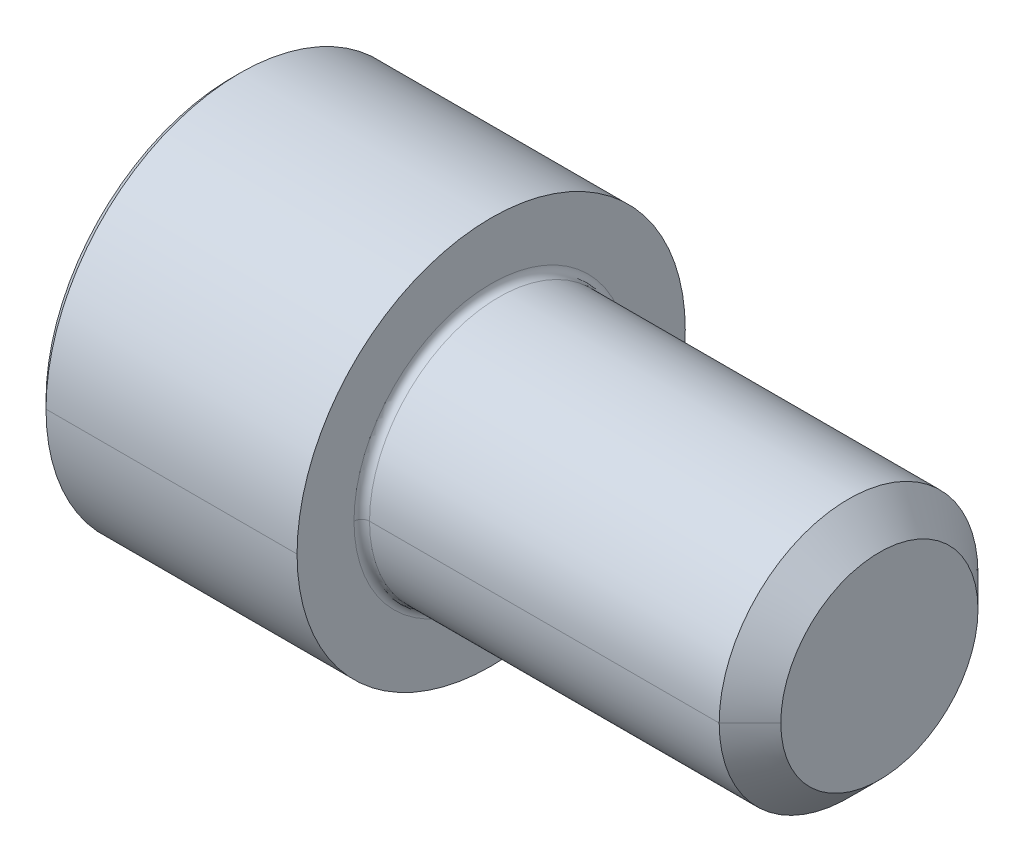
ISO-10303-21;
HEADER;
FILE_DESCRIPTION(('STEP AP214'),'2;1');
FILE_NAME('part.step','',(''),(''),'','','');
FILE_SCHEMA(('AUTOMOTIVE_DESIGN { 1 0 10303 214 1 1 1 1 }'));
ENDSEC;
DATA;
#1=APPLICATION_CONTEXT('core data for automotive mechanical design processes');
#2=APPLICATION_PROTOCOL_DEFINITION('international standard','automotive_design',2000,#1);
#3=PRODUCT_CONTEXT('',#1,'mechanical');
#4=PRODUCT('Part','Part','',(#3));
#5=PRODUCT_RELATED_PRODUCT_CATEGORY('part','',(#4));
#6=PRODUCT_DEFINITION_FORMATION('','',#4);
#7=PRODUCT_DEFINITION_CONTEXT('part definition',#1,'design');
#8=PRODUCT_DEFINITION('design','',#6,#7);
#9=PRODUCT_DEFINITION_SHAPE('','',#8);
#10=(LENGTH_UNIT() NAMED_UNIT(*) SI_UNIT(.MILLI.,.METRE.));
#11=(NAMED_UNIT(*) PLANE_ANGLE_UNIT() SI_UNIT($,.RADIAN.));
#12=(NAMED_UNIT(*) SI_UNIT($,.STERADIAN.) SOLID_ANGLE_UNIT());
#13=UNCERTAINTY_MEASURE_WITH_UNIT(LENGTH_MEASURE(1.E-05),#10,'distance_accuracy_value','');
#14=(GEOMETRIC_REPRESENTATION_CONTEXT(3) GLOBAL_UNCERTAINTY_ASSIGNED_CONTEXT((#13)) GLOBAL_UNIT_ASSIGNED_CONTEXT((#10,
#11,#12)) REPRESENTATION_CONTEXT('',''));
#15=CARTESIAN_POINT('',(0.,0.,0.));
#16=DIRECTION('',(0.,0.,1.));
#17=DIRECTION('',(1.,0.,0.));
#18=AXIS2_PLACEMENT_3D('',#15,#16,#17);
#19=CARTESIAN_POINT('',(-3.302,0.,0.));
#20=DIRECTION('',(-1.,0.,0.));
#21=DIRECTION('',(0.,1.,0.));
#22=AXIS2_PLACEMENT_3D('',#19,#20,#21);
#23=CONICAL_SURFACE('',#22,2.38125,1.0471975512);
#24=DIRECTION('',(-0.499999999997054,0.,-0.86602540378614));
#25=VECTOR('',#24,1.);
#26=CARTESIAN_POINT('',(-1.92718467150301,0.,0.));
#27=LINE('',#26,#25);
#28=CARTESIAN_POINT('',(-1.9271846714922,0.,0.));
#29=VERTEX_POINT('',#28);
#30=CARTESIAN_POINT('',(-3.302,0.,-2.38125));
#31=VERTEX_POINT('',#30);
#32=EDGE_CURVE('E11',#29,#31,#27,.T.);
#33=ORIENTED_EDGE('',*,*,#32,.T.);
#34=CARTESIAN_POINT('',(-3.302,0.,0.));
#35=DIRECTION('',(1.,0.,0.));
#36=DIRECTION('',(0.,0.,-1.));
#37=AXIS2_PLACEMENT_3D('',#34,#35,#36);
#38=CIRCLE('',#37,2.38125);
#39=CARTESIAN_POINT('',(-3.302,-2.06222299276169,-1.190625));
#40=VERTEX_POINT('',#39);
#41=EDGE_CURVE('E25',#40,#31,#38,.T.);
#42=ORIENTED_EDGE('',*,*,#41,.F.);
#43=CARTESIAN_POINT('',(-3.302,0.,0.));
#44=DIRECTION('',(1.,0.,0.));
#45=DIRECTION('',(0.,0.,-1.));
#46=AXIS2_PLACEMENT_3D('',#43,#44,#45);
#47=CIRCLE('',#46,2.38125);
#48=CARTESIAN_POINT('',(-3.302,-2.06222299276169,1.190625));
#49=VERTEX_POINT('',#48);
#50=EDGE_CURVE('E433',#49,#40,#47,.T.);
#51=ORIENTED_EDGE('',*,*,#50,.F.);
#52=CARTESIAN_POINT('',(-3.302,0.,0.));
#53=DIRECTION('',(1.,0.,0.));
#54=DIRECTION('',(0.,0.,-1.));
#55=AXIS2_PLACEMENT_3D('',#52,#53,#54);
#56=CIRCLE('',#55,2.38125);
#57=CARTESIAN_POINT('',(-3.302,0.,2.38125));
#58=VERTEX_POINT('',#57);
#59=EDGE_CURVE('E428',#58,#49,#56,.T.);
#60=ORIENTED_EDGE('',*,*,#59,.F.);
#61=DIRECTION('',(-0.499999999997054,0.,0.86602540378614));
#62=VECTOR('',#61,1.);
#63=CARTESIAN_POINT('',(-1.92718467150301,0.,0.));
#64=LINE('',#63,#62);
#65=EDGE_CURVE('E423',#29,#58,#64,.T.);
#66=ORIENTED_EDGE('',*,*,#65,.F.);
#67=EDGE_LOOP('',(#33,#42,#51,#60,#66));
#68=FACE_BOUND('',#67,.T.);
#69=ADVANCED_FACE('F17',(#68),#23,.F.);
#70=CARTESIAN_POINT('',(-3.302,0.,0.));
#71=DIRECTION('',(-1.,0.,0.));
#72=DIRECTION('',(0.,-1.,0.));
#73=AXIS2_PLACEMENT_3D('',#70,#71,#72);
#74=CONICAL_SURFACE('',#73,2.38125,1.0471975512);
#75=ORIENTED_EDGE('',*,*,#65,.T.);
#76=CARTESIAN_POINT('',(-3.302,0.,0.));
#77=DIRECTION('',(1.,0.,0.));
#78=DIRECTION('',(0.,0.,-1.));
#79=AXIS2_PLACEMENT_3D('',#76,#77,#78);
#80=CIRCLE('',#79,2.38125);
#81=CARTESIAN_POINT('',(-3.302,2.06222299276169,1.190625));
#82=VERTEX_POINT('',#81);
#83=EDGE_CURVE('E418',#82,#58,#80,.T.);
#84=ORIENTED_EDGE('',*,*,#83,.F.);
#85=CARTESIAN_POINT('',(-3.302,0.,0.));
#86=DIRECTION('',(1.,0.,0.));
#87=DIRECTION('',(0.,0.,-1.));
#88=AXIS2_PLACEMENT_3D('',#85,#86,#87);
#89=CIRCLE('',#88,2.38125);
#90=CARTESIAN_POINT('',(-3.302,2.0622229927617,-1.19062500000001));
#91=VERTEX_POINT('',#90);
#92=EDGE_CURVE('E413',#91,#82,#89,.T.);
#93=ORIENTED_EDGE('',*,*,#92,.F.);
#94=CARTESIAN_POINT('',(-3.302,0.,0.));
#95=DIRECTION('',(1.,0.,0.));
#96=DIRECTION('',(0.,0.,-1.));
#97=AXIS2_PLACEMENT_3D('',#94,#95,#96);
#98=CIRCLE('',#97,2.38125);
#99=EDGE_CURVE('E408',#31,#91,#98,.T.);
#100=ORIENTED_EDGE('',*,*,#99,.F.);
#101=ORIENTED_EDGE('',*,*,#32,.F.);
#102=EDGE_LOOP('',(#75,#84,#93,#100,#101));
#103=FACE_BOUND('',#102,.T.);
#104=ADVANCED_FACE('F466',(#103),#74,.F.);
#105=CARTESIAN_POINT('',(-3.302,0.,0.));
#106=DIRECTION('',(1.,0.,0.));
#107=DIRECTION('',(0.,0.,-1.));
#108=AXIS2_PLACEMENT_3D('',#105,#106,#107);
#109=PLANE('',#108);
#110=ORIENTED_EDGE('',*,*,#99,.T.);
#111=DIRECTION('',(0.,0.500000000000001,0.866025403784438));
#112=VECTOR('',#111,1.);
#113=CARTESIAN_POINT('',(-3.302,1.3748153285078,-2.38125));
#114=LINE('',#113,#112);
#115=CARTESIAN_POINT('',(-3.302,1.3748153285078,-2.38125));
#116=VERTEX_POINT('',#115);
#117=EDGE_CURVE('E403',#116,#91,#114,.T.);
#118=ORIENTED_EDGE('',*,*,#117,.F.);
#119=DIRECTION('',(0.,1.,0.));
#120=VECTOR('',#119,1.);
#121=CARTESIAN_POINT('',(-3.302,-1.3748153285078,-2.38125));
#122=LINE('',#121,#120);
#123=EDGE_CURVE('E398',#31,#116,#122,.T.);
#124=ORIENTED_EDGE('',*,*,#123,.F.);
#125=EDGE_LOOP('',(#110,#118,#124));
#126=FACE_BOUND('',#125,.T.);
#127=ADVANCED_FACE('F482',(#126),#109,.F.);
#128=CARTESIAN_POINT('',(-3.302,-1.3748153285078,-2.38125));
#129=DIRECTION('',(0.,0.,1.));
#130=DIRECTION('',(1.,0.,0.));
#131=AXIS2_PLACEMENT_3D('',#128,#129,#130);
#132=PLANE('',#131);
#133=DIRECTION('',(0.,1.,0.));
#134=VECTOR('',#133,1.);
#135=CARTESIAN_POINT('',(-6.35,-1.3748153285078,-2.38125));
#136=LINE('',#135,#134);
#137=CARTESIAN_POINT('',(-6.35,-1.3748153285078,-2.38125));
#138=VERTEX_POINT('',#137);
#139=CARTESIAN_POINT('',(-6.35,1.3748153285078,-2.38125));
#140=VERTEX_POINT('',#139);
#141=EDGE_CURVE('E393',#138,#140,#136,.T.);
#142=ORIENTED_EDGE('',*,*,#141,.F.);
#143=DIRECTION('',(-1.,0.,0.));
#144=VECTOR('',#143,1.);
#145=CARTESIAN_POINT('',(-3.302,-1.3748153285078,-2.38125));
#146=LINE('',#145,#144);
#147=CARTESIAN_POINT('',(-3.302,-1.3748153285078,-2.38125));
#148=VERTEX_POINT('',#147);
#149=EDGE_CURVE('E388',#148,#138,#146,.T.);
#150=ORIENTED_EDGE('',*,*,#149,.F.);
#151=DIRECTION('',(0.,1.,0.));
#152=VECTOR('',#151,1.);
#153=CARTESIAN_POINT('',(-3.302,-1.3748153285078,-2.38125));
#154=LINE('',#153,#152);
#155=EDGE_CURVE('E383',#148,#31,#154,.T.);
#156=ORIENTED_EDGE('',*,*,#155,.T.);
#157=ORIENTED_EDGE('',*,*,#123,.T.);
#158=DIRECTION('',(-1.,0.,0.));
#159=VECTOR('',#158,1.);
#160=CARTESIAN_POINT('',(-3.302,1.3748153285078,-2.38125));
#161=LINE('',#160,#159);
#162=EDGE_CURVE('E379',#116,#140,#161,.T.);
#163=ORIENTED_EDGE('',*,*,#162,.T.);
#164=EDGE_LOOP('',(#142,#150,#156,#157,#163));
#165=FACE_BOUND('',#164,.T.);
#166=ADVANCED_FACE('F484',(#165),#132,.T.);
#167=CARTESIAN_POINT('',(-3.302,1.3748153285078,-2.38125));
#168=DIRECTION('',(0.,-0.866025403784438,0.500000000000001));
#169=DIRECTION('',(0.,-0.500000000000001,-0.866025403784438));
#170=AXIS2_PLACEMENT_3D('',#167,#168,#169);
#171=PLANE('',#170);
#172=DIRECTION('',(0.,0.500000000000001,0.866025403784438));
#173=VECTOR('',#172,1.);
#174=CARTESIAN_POINT('',(-6.35,1.3748153285078,-2.38125));
#175=LINE('',#174,#173);
#176=CARTESIAN_POINT('',(-6.35,2.7496306570156,0.));
#177=VERTEX_POINT('',#176);
#178=EDGE_CURVE('E374',#140,#177,#175,.T.);
#179=ORIENTED_EDGE('',*,*,#178,.F.);
#180=ORIENTED_EDGE('',*,*,#162,.F.);
#181=ORIENTED_EDGE('',*,*,#117,.T.);
#182=DIRECTION('',(0.,0.500000000000001,0.866025403784438));
#183=VECTOR('',#182,1.);
#184=CARTESIAN_POINT('',(-3.302,1.3748153285078,-2.38125));
#185=LINE('',#184,#183);
#186=CARTESIAN_POINT('',(-3.302,2.7496306570156,0.));
#187=VERTEX_POINT('',#186);
#188=EDGE_CURVE('E370',#91,#187,#185,.T.);
#189=ORIENTED_EDGE('',*,*,#188,.T.);
#190=DIRECTION('',(-1.,0.,0.));
#191=VECTOR('',#190,1.);
#192=CARTESIAN_POINT('',(-3.302,2.7496306570156,0.));
#193=LINE('',#192,#191);
#194=EDGE_CURVE('E366',#187,#177,#193,.T.);
#195=ORIENTED_EDGE('',*,*,#194,.T.);
#196=EDGE_LOOP('',(#179,#180,#181,#189,#195));
#197=FACE_BOUND('',#196,.T.);
#198=ADVANCED_FACE('F478',(#197),#171,.T.);
#199=CARTESIAN_POINT('',(-3.302,2.7496306570156,0.));
#200=DIRECTION('',(0.,-0.866025403784438,-0.500000000000001));
#201=DIRECTION('',(0.,0.500000000000001,-0.866025403784438));
#202=AXIS2_PLACEMENT_3D('',#199,#200,#201);
#203=PLANE('',#202);
#204=DIRECTION('',(0.,-0.500000000000001,0.866025403784438));
#205=VECTOR('',#204,1.);
#206=CARTESIAN_POINT('',(-6.35,2.7496306570156,0.));
#207=LINE('',#206,#205);
#208=CARTESIAN_POINT('',(-6.35,1.3748153285078,2.38125));
#209=VERTEX_POINT('',#208);
#210=EDGE_CURVE('E361',#177,#209,#207,.T.);
#211=ORIENTED_EDGE('',*,*,#210,.F.);
#212=ORIENTED_EDGE('',*,*,#194,.F.);
#213=DIRECTION('',(0.,-0.500000000000001,0.866025403784438));
#214=VECTOR('',#213,1.);
#215=CARTESIAN_POINT('',(-3.302,2.7496306570156,0.));
#216=LINE('',#215,#214);
#217=EDGE_CURVE('E356',#187,#82,#216,.T.);
#218=ORIENTED_EDGE('',*,*,#217,.T.);
#219=DIRECTION('',(0.,-0.500000000000001,0.866025403784438));
#220=VECTOR('',#219,1.);
#221=CARTESIAN_POINT('',(-3.302,2.7496306570156,0.));
#222=LINE('',#221,#220);
#223=CARTESIAN_POINT('',(-3.302,1.3748153285078,2.38125));
#224=VERTEX_POINT('',#223);
#225=EDGE_CURVE('E352',#82,#224,#222,.T.);
#226=ORIENTED_EDGE('',*,*,#225,.T.);
#227=DIRECTION('',(-1.,0.,0.));
#228=VECTOR('',#227,1.);
#229=CARTESIAN_POINT('',(-3.302,1.3748153285078,2.38125));
#230=LINE('',#229,#228);
#231=EDGE_CURVE('E348',#224,#209,#230,.T.);
#232=ORIENTED_EDGE('',*,*,#231,.T.);
#233=EDGE_LOOP('',(#211,#212,#218,#226,#232));
#234=FACE_BOUND('',#233,.T.);
#235=ADVANCED_FACE('F471',(#234),#203,.T.);
#236=CARTESIAN_POINT('',(-3.302,1.3748153285078,2.38125));
#237=DIRECTION('',(0.,0.,-1.));
#238=DIRECTION('',(-1.,0.,0.));
#239=AXIS2_PLACEMENT_3D('',#236,#237,#238);
#240=PLANE('',#239);
#241=DIRECTION('',(0.,-1.,0.));
#242=VECTOR('',#241,1.);
#243=CARTESIAN_POINT('',(-6.35,1.3748153285078,2.38125));
#244=LINE('',#243,#242);
#245=CARTESIAN_POINT('',(-6.35,-1.3748153285078,2.38125));
#246=VERTEX_POINT('',#245);
#247=EDGE_CURVE('E343',#209,#246,#244,.T.);
#248=ORIENTED_EDGE('',*,*,#247,.F.);
#249=ORIENTED_EDGE('',*,*,#231,.F.);
#250=DIRECTION('',(0.,-1.,0.));
#251=VECTOR('',#250,1.);
#252=CARTESIAN_POINT('',(-3.302,1.3748153285078,2.38125));
#253=LINE('',#252,#251);
#254=EDGE_CURVE('E338',#224,#58,#253,.T.);
#255=ORIENTED_EDGE('',*,*,#254,.T.);
#256=DIRECTION('',(0.,-1.,0.));
#257=VECTOR('',#256,1.);
#258=CARTESIAN_POINT('',(-3.302,1.3748153285078,2.38125));
#259=LINE('',#258,#257);
#260=CARTESIAN_POINT('',(-3.302,-1.3748153285078,2.38125));
#261=VERTEX_POINT('',#260);
#262=EDGE_CURVE('E334',#58,#261,#259,.T.);
#263=ORIENTED_EDGE('',*,*,#262,.T.);
#264=DIRECTION('',(-1.,0.,0.));
#265=VECTOR('',#264,1.);
#266=CARTESIAN_POINT('',(-3.302,-1.3748153285078,2.38125));
#267=LINE('',#266,#265);
#268=EDGE_CURVE('E330',#261,#246,#267,.T.);
#269=ORIENTED_EDGE('',*,*,#268,.T.);
#270=EDGE_LOOP('',(#248,#249,#255,#263,#269));
#271=FACE_BOUND('',#270,.T.);
#272=ADVANCED_FACE('F490',(#271),#240,.T.);
#273=CARTESIAN_POINT('',(-3.302,-1.3748153285078,2.38125));
#274=DIRECTION('',(0.,0.866025403784438,-0.500000000000001));
#275=DIRECTION('',(0.,0.500000000000001,0.866025403784438));
#276=AXIS2_PLACEMENT_3D('',#273,#274,#275);
#277=PLANE('',#276);
#278=DIRECTION('',(0.,-0.500000000000001,-0.866025403784438));
#279=VECTOR('',#278,1.);
#280=CARTESIAN_POINT('',(-6.35,-1.3748153285078,2.38125));
#281=LINE('',#280,#279);
#282=CARTESIAN_POINT('',(-6.35,-2.7496306570156,0.));
#283=VERTEX_POINT('',#282);
#284=EDGE_CURVE('E325',#246,#283,#281,.T.);
#285=ORIENTED_EDGE('',*,*,#284,.F.);
#286=ORIENTED_EDGE('',*,*,#268,.F.);
#287=DIRECTION('',(0.,-0.500000000000001,-0.866025403784438));
#288=VECTOR('',#287,1.);
#289=CARTESIAN_POINT('',(-3.302,-1.3748153285078,2.38125));
#290=LINE('',#289,#288);
#291=EDGE_CURVE('E320',#261,#49,#290,.T.);
#292=ORIENTED_EDGE('',*,*,#291,.T.);
#293=DIRECTION('',(0.,-0.500000000000001,-0.866025403784438));
#294=VECTOR('',#293,1.);
#295=CARTESIAN_POINT('',(-3.302,-1.3748153285078,2.38125));
#296=LINE('',#295,#294);
#297=CARTESIAN_POINT('',(-3.302,-2.7496306570156,0.));
#298=VERTEX_POINT('',#297);
#299=EDGE_CURVE('E316',#49,#298,#296,.T.);
#300=ORIENTED_EDGE('',*,*,#299,.T.);
#301=DIRECTION('',(-1.,0.,0.));
#302=VECTOR('',#301,1.);
#303=CARTESIAN_POINT('',(-3.302,-2.7496306570156,0.));
#304=LINE('',#303,#302);
#305=EDGE_CURVE('E312',#298,#283,#304,.T.);
#306=ORIENTED_EDGE('',*,*,#305,.T.);
#307=EDGE_LOOP('',(#285,#286,#292,#300,#306));
#308=FACE_BOUND('',#307,.T.);
#309=ADVANCED_FACE('F455',(#308),#277,.T.);
#310=CARTESIAN_POINT('',(-3.302,-2.7496306570156,0.));
#311=DIRECTION('',(0.,0.866025403784438,0.500000000000001));
#312=DIRECTION('',(0.,-0.500000000000001,0.866025403784438));
#313=AXIS2_PLACEMENT_3D('',#310,#311,#312);
#314=PLANE('',#313);
#315=DIRECTION('',(0.,0.500000000000001,-0.866025403784438));
#316=VECTOR('',#315,1.);
#317=CARTESIAN_POINT('',(-6.35,-2.7496306570156,0.));
#318=LINE('',#317,#316);
#319=EDGE_CURVE('E307',#283,#138,#318,.T.);
#320=ORIENTED_EDGE('',*,*,#319,.F.);
#321=ORIENTED_EDGE('',*,*,#305,.F.);
#322=DIRECTION('',(0.,0.500000000000001,-0.866025403784438));
#323=VECTOR('',#322,1.);
#324=CARTESIAN_POINT('',(-3.302,-2.7496306570156,0.));
#325=LINE('',#324,#323);
#326=EDGE_CURVE('E303',#298,#40,#325,.T.);
#327=ORIENTED_EDGE('',*,*,#326,.T.);
#328=DIRECTION('',(0.,0.500000000000001,-0.866025403784438));
#329=VECTOR('',#328,1.);
#330=CARTESIAN_POINT('',(-3.302,-2.7496306570156,0.));
#331=LINE('',#330,#329);
#332=EDGE_CURVE('E298',#40,#148,#331,.T.);
#333=ORIENTED_EDGE('',*,*,#332,.T.);
#334=ORIENTED_EDGE('',*,*,#149,.T.);
#335=EDGE_LOOP('',(#320,#321,#327,#333,#334));
#336=FACE_BOUND('',#335,.T.);
#337=ADVANCED_FACE('F486',(#336),#314,.T.);
#338=CARTESIAN_POINT('',(-3.302,0.,0.));
#339=DIRECTION('',(1.,0.,0.));
#340=DIRECTION('',(0.,0.,-1.));
#341=AXIS2_PLACEMENT_3D('',#338,#339,#340);
#342=PLANE('',#341);
#343=ORIENTED_EDGE('',*,*,#41,.T.);
#344=ORIENTED_EDGE('',*,*,#155,.F.);
#345=ORIENTED_EDGE('',*,*,#332,.F.);
#346=EDGE_LOOP('',(#343,#344,#345));
#347=FACE_BOUND('',#346,.T.);
#348=ADVANCED_FACE('F445',(#347),#342,.F.);
#349=CARTESIAN_POINT('',(-3.302,0.,0.));
#350=DIRECTION('',(1.,0.,0.));
#351=DIRECTION('',(0.,0.,-1.));
#352=AXIS2_PLACEMENT_3D('',#349,#350,#351);
#353=PLANE('',#352);
#354=ORIENTED_EDGE('',*,*,#50,.T.);
#355=ORIENTED_EDGE('',*,*,#326,.F.);
#356=ORIENTED_EDGE('',*,*,#299,.F.);
#357=EDGE_LOOP('',(#354,#355,#356));
#358=FACE_BOUND('',#357,.T.);
#359=ADVANCED_FACE('F450',(#358),#353,.F.);
#360=CARTESIAN_POINT('',(-6.35,0.,0.));
#361=DIRECTION('',(1.,0.,0.));
#362=DIRECTION('',(0.,0.,-1.));
#363=AXIS2_PLACEMENT_3D('',#360,#361,#362);
#364=PLANE('',#363);
#365=CARTESIAN_POINT('',(-6.35,0.,0.));
#366=DIRECTION('',(1.,0.,0.));
#367=DIRECTION('',(0.,0.,-1.));
#368=AXIS2_PLACEMENT_3D('',#365,#366,#367);
#369=CIRCLE('',#368,4.572);
#370=CARTESIAN_POINT('',(-6.35,0.,-4.572));
#371=VERTEX_POINT('',#370);
#372=CARTESIAN_POINT('',(-6.35,0.,4.572));
#373=VERTEX_POINT('',#372);
#374=EDGE_CURVE('E293',#371,#373,#369,.T.);
#375=ORIENTED_EDGE('',*,*,#374,.F.);
#376=CARTESIAN_POINT('',(-6.35,0.,0.));
#377=DIRECTION('',(1.,0.,0.));
#378=DIRECTION('',(0.,0.,-1.));
#379=AXIS2_PLACEMENT_3D('',#376,#377,#378);
#380=CIRCLE('',#379,4.572);
#381=EDGE_CURVE('E288',#373,#371,#380,.T.);
#382=ORIENTED_EDGE('',*,*,#381,.F.);
#383=EDGE_LOOP('',(#375,#382));
#384=FACE_BOUND('',#383,.T.);
#385=ORIENTED_EDGE('',*,*,#247,.T.);
#386=ORIENTED_EDGE('',*,*,#284,.T.);
#387=ORIENTED_EDGE('',*,*,#319,.T.);
#388=ORIENTED_EDGE('',*,*,#141,.T.);
#389=ORIENTED_EDGE('',*,*,#178,.T.);
#390=ORIENTED_EDGE('',*,*,#210,.T.);
#391=EDGE_LOOP('',(#385,#386,#387,#388,#389,#390));
#392=FACE_BOUND('',#391,.T.);
#393=ADVANCED_FACE('F488',(#384,#392),#364,.F.);
#394=CARTESIAN_POINT('',(-6.35,0.,0.));
#395=DIRECTION('',(1.,0.,0.));
#396=DIRECTION('',(0.,1.,0.));
#397=AXIS2_PLACEMENT_3D('',#394,#395,#396);
#398=CONICAL_SURFACE('',#397,4.572,0.7853981634);
#399=ORIENTED_EDGE('',*,*,#381,.T.);
#400=DIRECTION('',(0.707106781184748,0.,-0.707106781188348));
#401=VECTOR('',#400,1.);
#402=CARTESIAN_POINT('',(-6.35,0.,-4.572));
#403=LINE('',#402,#401);
#404=CARTESIAN_POINT('',(-6.1595,0.,-4.7625));
#405=VERTEX_POINT('',#404);
#406=EDGE_CURVE('E284',#371,#405,#403,.T.);
#407=ORIENTED_EDGE('',*,*,#406,.T.);
#408=CARTESIAN_POINT('',(-6.1595,0.,0.));
#409=DIRECTION('',(1.,0.,0.));
#410=DIRECTION('',(0.,0.,-1.));
#411=AXIS2_PLACEMENT_3D('',#408,#409,#410);
#412=CIRCLE('',#411,4.7625);
#413=CARTESIAN_POINT('',(-6.1595,0.,4.7625));
#414=VERTEX_POINT('',#413);
#415=EDGE_CURVE('E279',#414,#405,#412,.T.);
#416=ORIENTED_EDGE('',*,*,#415,.F.);
#417=DIRECTION('',(0.707106781184748,0.,0.707106781188348));
#418=VECTOR('',#417,1.);
#419=CARTESIAN_POINT('',(-6.35,0.,4.572));
#420=LINE('',#419,#418);
#421=EDGE_CURVE('E274',#373,#414,#420,.T.);
#422=ORIENTED_EDGE('',*,*,#421,.F.);
#423=EDGE_LOOP('',(#399,#407,#416,#422));
#424=FACE_BOUND('',#423,.T.);
#425=ADVANCED_FACE('F567',(#424),#398,.T.);
#426=CARTESIAN_POINT('',(-6.35,0.,0.));
#427=DIRECTION('',(1.,0.,0.));
#428=DIRECTION('',(0.,-1.,0.));
#429=AXIS2_PLACEMENT_3D('',#426,#427,#428);
#430=CONICAL_SURFACE('',#429,4.572,0.7853981634);
#431=CARTESIAN_POINT('',(-6.1595,0.,0.));
#432=DIRECTION('',(1.,0.,0.));
#433=DIRECTION('',(0.,0.,-1.));
#434=AXIS2_PLACEMENT_3D('',#431,#432,#433);
#435=CIRCLE('',#434,4.7625);
#436=EDGE_CURVE('E269',#405,#414,#435,.T.);
#437=ORIENTED_EDGE('',*,*,#436,.F.);
#438=ORIENTED_EDGE('',*,*,#406,.F.);
#439=ORIENTED_EDGE('',*,*,#374,.T.);
#440=ORIENTED_EDGE('',*,*,#421,.T.);
#441=EDGE_LOOP('',(#437,#438,#439,#440));
#442=FACE_BOUND('',#441,.T.);
#443=ADVANCED_FACE('F577',(#442),#430,.T.);
#444=CARTESIAN_POINT('',(9.525,0.,0.));
#445=DIRECTION('',(-1.,0.,0.));
#446=DIRECTION('',(0.,-1.,0.));
#447=AXIS2_PLACEMENT_3D('',#444,#445,#446);
#448=CYLINDRICAL_SURFACE('',#447,4.7625);
#449=CARTESIAN_POINT('',(0.,0.,0.));
#450=DIRECTION('',(1.,0.,0.));
#451=DIRECTION('',(0.,0.,-1.));
#452=AXIS2_PLACEMENT_3D('',#449,#450,#451);
#453=CIRCLE('',#452,4.7625);
#454=CARTESIAN_POINT('',(0.,0.,-4.7625));
#455=VERTEX_POINT('',#454);
#456=CARTESIAN_POINT('',(0.,0.,4.7625));
#457=VERTEX_POINT('',#456);
#458=EDGE_CURVE('E264',#455,#457,#453,.T.);
#459=ORIENTED_EDGE('',*,*,#458,.F.);
#460=DIRECTION('',(-1.,0.,0.));
#461=VECTOR('',#460,1.);
#462=CARTESIAN_POINT('',(0.,0.,-4.7625));
#463=LINE('',#462,#461);
#464=EDGE_CURVE('E259',#455,#405,#463,.T.);
#465=ORIENTED_EDGE('',*,*,#464,.T.);
#466=ORIENTED_EDGE('',*,*,#436,.T.);
#467=DIRECTION('',(-1.,0.,0.));
#468=VECTOR('',#467,1.);
#469=CARTESIAN_POINT('',(0.,0.,4.7625));
#470=LINE('',#469,#468);
#471=EDGE_CURVE('E254',#457,#414,#470,.T.);
#472=ORIENTED_EDGE('',*,*,#471,.F.);
#473=EDGE_LOOP('',(#459,#465,#466,#472));
#474=FACE_BOUND('',#473,.T.);
#475=ADVANCED_FACE('F587',(#474),#448,.T.);
#476=CARTESIAN_POINT('',(9.525,0.,0.));
#477=DIRECTION('',(-1.,0.,0.));
#478=DIRECTION('',(0.,1.,0.));
#479=AXIS2_PLACEMENT_3D('',#476,#477,#478);
#480=CYLINDRICAL_SURFACE('',#479,4.7625);
#481=ORIENTED_EDGE('',*,*,#415,.T.);
#482=ORIENTED_EDGE('',*,*,#464,.F.);
#483=CARTESIAN_POINT('',(0.,0.,0.));
#484=DIRECTION('',(1.,0.,0.));
#485=DIRECTION('',(0.,0.,-1.));
#486=AXIS2_PLACEMENT_3D('',#483,#484,#485);
#487=CIRCLE('',#486,4.7625);
#488=EDGE_CURVE('E249',#457,#455,#487,.T.);
#489=ORIENTED_EDGE('',*,*,#488,.F.);
#490=ORIENTED_EDGE('',*,*,#471,.T.);
#491=EDGE_LOOP('',(#481,#482,#489,#490));
#492=FACE_BOUND('',#491,.T.);
#493=ADVANCED_FACE('F597',(#492),#480,.T.);
#494=CARTESIAN_POINT('',(0.,4.7625,0.));
#495=DIRECTION('',(-1.,0.,0.));
#496=DIRECTION('',(0.,0.,1.));
#497=AXIS2_PLACEMENT_3D('',#494,#495,#496);
#498=PLANE('',#497);
#499=CARTESIAN_POINT('',(0.,0.,0.));
#500=DIRECTION('',(1.,0.,0.));
#501=DIRECTION('',(0.,0.,-1.));
#502=AXIS2_PLACEMENT_3D('',#499,#500,#501);
#503=CIRCLE('',#502,3.3655);
#504=CARTESIAN_POINT('',(0.,0.,-3.3655));
#505=VERTEX_POINT('',#504);
#506=CARTESIAN_POINT('',(0.,0.,3.3655));
#507=VERTEX_POINT('',#506);
#508=EDGE_CURVE('E245',#505,#507,#503,.T.);
#509=ORIENTED_EDGE('',*,*,#508,.F.);
#510=CARTESIAN_POINT('',(0.,0.,0.));
#511=DIRECTION('',(1.,0.,0.));
#512=DIRECTION('',(0.,0.,-1.));
#513=AXIS2_PLACEMENT_3D('',#510,#511,#512);
#514=CIRCLE('',#513,3.3655);
#515=EDGE_CURVE('E241',#507,#505,#514,.T.);
#516=ORIENTED_EDGE('',*,*,#515,.F.);
#517=EDGE_LOOP('',(#509,#516));
#518=FACE_BOUND('',#517,.T.);
#519=ORIENTED_EDGE('',*,*,#458,.T.);
#520=ORIENTED_EDGE('',*,*,#488,.T.);
#521=EDGE_LOOP('',(#519,#520));
#522=FACE_BOUND('',#521,.T.);
#523=ADVANCED_FACE('F607',(#518,#522),#498,.F.);
#524=CARTESIAN_POINT('',(0.190500000000065,0.,0.));
#525=DIRECTION('',(1.,0.,0.));
#526=DIRECTION('',(0.,1.,0.));
#527=AXIS2_PLACEMENT_3D('',#524,#525,#526);
#528=TOROIDAL_SURFACE('',#527,3.3655,0.1905);
#529=CARTESIAN_POINT('',(0.1905,0.,0.));
#530=DIRECTION('',(1.,0.,0.));
#531=DIRECTION('',(0.,0.,-1.));
#532=AXIS2_PLACEMENT_3D('',#529,#530,#531);
#533=CIRCLE('',#532,3.175);
#534=CARTESIAN_POINT('',(0.1905,0.,3.175));
#535=VERTEX_POINT('',#534);
#536=CARTESIAN_POINT('',(0.1905,0.,-3.175));
#537=VERTEX_POINT('',#536);
#538=EDGE_CURVE('E238',#535,#537,#533,.T.);
#539=ORIENTED_EDGE('',*,*,#538,.F.);
#540=CARTESIAN_POINT('',(0.1905,0.,3.175));
#541=CARTESIAN_POINT('',(0.187382947891301,0.,3.17499993387959));
#542=CARTESIAN_POINT('',(0.184265901408801,0.,3.17507650153766));
#543=CARTESIAN_POINT('',(0.178039314672457,0.,3.17538242964818));
#544=CARTESIAN_POINT('',(0.174929774418612,0.,3.17561179010062));
#545=CARTESIAN_POINT('',(0.168725695115834,0.,3.17622282903729));
#546=CARTESIAN_POINT('',(0.165631156066901,0.,3.17660450752151));
#547=CARTESIAN_POINT('',(0.159464533165619,0.,3.17751924218192));
#548=CARTESIAN_POINT('',(0.15639244931327,0.,3.17805229835811));
#549=CARTESIAN_POINT('',(0.150278137998604,0.,3.17926850980828));
#550=CARTESIAN_POINT('',(0.147235910536287,0.,3.17995166508226));
#551=CARTESIAN_POINT('',(0.141188640920593,0.,3.18146642745065));
#552=CARTESIAN_POINT('',(0.138183598767217,0.,3.18229803454507));
#553=CARTESIAN_POINT('',(0.132217939198862,0.,3.18410769754099));
#554=CARTESIAN_POINT('',(0.129257321783883,0.,3.18508575344249));
#555=CARTESIAN_POINT('',(0.123387644073716,0.,3.18718595772281));
#556=CARTESIAN_POINT('',(0.120478583778528,0.,3.18830810610162));
#557=CARTESIAN_POINT('',(0.114719028490413,0.,3.19069379201161));
#558=CARTESIAN_POINT('',(0.111868533497485,0.,3.19195732954279));
#559=CARTESIAN_POINT('',(0.106232975905623,0.,3.19462274977721));
#560=CARTESIAN_POINT('',(0.103447913306688,0.,3.19602463248046));
#561=CARTESIAN_POINT('',(0.0979499299626576,0.,3.19896336580286));
#562=CARTESIAN_POINT('',(0.0952370092175612,0.,3.20050021642201));
#563=CARTESIAN_POINT('',(0.0898898452448781,0.,3.20370518316793));
#564=CARTESIAN_POINT('',(0.0872556020172913,0.,3.20537329929468));
#565=CARTESIAN_POINT('',(0.0820721392023026,0.,3.20883677841809));
#566=CARTESIAN_POINT('',(0.0795229196149005,0.,3.21063214141474));
#567=CARTESIAN_POINT('',(0.0745156453735504,0.,3.21434578909118));
#568=CARTESIAN_POINT('',(0.0720575907196023,0.,3.21626407377097));
#569=CARTESIAN_POINT('',(0.0672385680141222,0.,3.22021894349788));
#570=CARTESIAN_POINT('',(0.0648775999625902,0.,3.222255528545));
#571=CARTESIAN_POINT('',(0.0602584382407745,0.,3.22644209269481));
#572=CARTESIAN_POINT('',(0.0580002445704908,0.,3.2285920717975));
#573=CARTESIAN_POINT('',(0.0535920717975183,0.,3.23300024457047));
#574=CARTESIAN_POINT('',(0.0514420926948295,0.,3.23525843824076));
#575=CARTESIAN_POINT('',(0.04725552854502,0.,3.23987759996257));
#576=CARTESIAN_POINT('',(0.0452189434978993,0.,3.24223856801411));
#577=CARTESIAN_POINT('',(0.0412640737709915,0.,3.24705759071959));
#578=CARTESIAN_POINT('',(0.0393457890912043,0.,3.24951564537354));
#579=CARTESIAN_POINT('',(0.0356321414147681,0.,3.25452291961489));
#580=CARTESIAN_POINT('',(0.0338367784181192,0.,3.25707213920229));
#581=CARTESIAN_POINT('',(0.0303732992947136,0.,3.26225560201728));
#582=CARTESIAN_POINT('',(0.0287051831679568,0.,3.26488984524487));
#583=CARTESIAN_POINT('',(0.0255002164220461,0.,3.27023700921755));
#584=CARTESIAN_POINT('',(0.0239633658028922,0.,3.27294992996265));
#585=CARTESIAN_POINT('',(0.0210246324804949,0.,3.27844791330668));
#586=CARTESIAN_POINT('',(0.0196227497772514,0.,3.28123297590562));
#587=CARTESIAN_POINT('',(0.0169573295428305,0.,3.28686853349748));
#588=CARTESIAN_POINT('',(0.0156937920116531,0.,3.28971902849041));
#589=CARTESIAN_POINT('',(0.0133081061016636,0.,3.29547858377852));
#590=CARTESIAN_POINT('',(0.0121859577228516,0.,3.29838764407371));
#591=CARTESIAN_POINT('',(0.0100857534425373,0.,3.30425732178388));
#592=CARTESIAN_POINT('',(0.00910769754103512,0.,3.30721793919886));
#593=CARTESIAN_POINT('',(0.00729803454511551,0.,3.31318359876721));
#594=CARTESIAN_POINT('',(0.00646642745069811,0.,3.31618864092059));
#595=CARTESIAN_POINT('',(0.00495166508230498,0.,3.32223591053628));
#596=CARTESIAN_POINT('',(0.00426850980832925,0.,3.3252781379986));
#597=CARTESIAN_POINT('',(0.00305229835816601,0.,3.33139244931327));
#598=CARTESIAN_POINT('',(0.0025192421819785,0.,3.33446453316562));
#599=CARTESIAN_POINT('',(0.00160450752156733,0.,3.3406311560669));
#600=CARTESIAN_POINT('',(0.00122282903734368,0.,3.34372569511583));
#601=CARTESIAN_POINT('',(0.000611790100677661,0.,3.34992977441861));
#602=CARTESIAN_POINT('',(0.000382429648235299,0.,3.35303931467246));
#603=CARTESIAN_POINT('',(7.65015377229054E-05,0.,3.3592659014088));
#604=CARTESIAN_POINT('',(-6.61203471253003E-08,0.,3.3623829478913));
#605=CARTESIAN_POINT('',(0.,0.,3.3655));
#606=B_SPLINE_CURVE_WITH_KNOTS('',3,(#540,#541,#542,#543,#544,#545,#546,#547,#548,#549,#550,
#551,#552,#553,#554,#555,#556,#557,#558,#559,#560,#561,#562,#563,#564,#565,#566,#567,#568,#569,
#570,#571,#572,#573,#574,#575,#576,#577,#578,#579,#580,#581,#582,#583,#584,#585,#586,#587,#588,
#589,#590,#591,#592,#593,#594,#595,#596,#597,#598,#599,#600,#601,#602,#603,#604,#605),
.UNSPECIFIED.,.F.,.F.,(4,2,2,2,2,2,2,2,2,2,2,2,2,2,2,2,2,2,2,2,2,2,2,2,2,2,2,2,2,2,2,2,4),(0.,
0.00935020806722752,0.0187004161344551,0.0280506242016826,0.0374008322689102,0.0467510403361378,
0.0561012484033654,0.0654514564705928,0.0748016645378205,0.084151872605048,0.0935020806722756,
0.102852288739503,0.112202496806731,0.121552704873958,0.130902912941186,0.140253121008414,
0.149603329075641,0.158953537142868,0.168303745210096,0.177653953277323,0.187004161344551,
0.196354369411779,0.205704577479006,0.215054785546234,0.224404993613461,0.233755201680689,
0.243105409747917,0.252455617815144,0.261805825882372,0.271156033949599,0.280506242016827,
0.289856450084054,0.299206658151282),.UNSPECIFIED.);
#607=EDGE_CURVE('E215',#535,#507,#606,.T.);
#608=ORIENTED_EDGE('',*,*,#607,.T.);
#609=ORIENTED_EDGE('',*,*,#515,.T.);
#610=CARTESIAN_POINT('',(0.1905,0.,-3.175));
#611=CARTESIAN_POINT('',(0.187382947891301,0.,-3.17499993387959));
#612=CARTESIAN_POINT('',(0.184265901408801,0.,-3.17507650153766));
#613=CARTESIAN_POINT('',(0.178039314672456,0.,-3.17538242964818));
#614=CARTESIAN_POINT('',(0.174929774418612,0.,-3.17561179010062));
#615=CARTESIAN_POINT('',(0.168725695115834,0.,-3.17622282903729));
#616=CARTESIAN_POINT('',(0.165631156066901,0.,-3.17660450752151));
#617=CARTESIAN_POINT('',(0.159464533165619,0.,-3.17751924218192));
#618=CARTESIAN_POINT('',(0.15639244931327,0.,-3.17805229835811));
#619=CARTESIAN_POINT('',(0.150278137998603,0.,-3.17926850980828));
#620=CARTESIAN_POINT('',(0.147235910536287,0.,-3.17995166508226));
#621=CARTESIAN_POINT('',(0.141188640920593,0.,-3.18146642745065));
#622=CARTESIAN_POINT('',(0.138183598767217,0.,-3.18229803454507));
#623=CARTESIAN_POINT('',(0.132217939198862,0.,-3.18410769754099));
#624=CARTESIAN_POINT('',(0.129257321783882,0.,-3.18508575344249));
#625=CARTESIAN_POINT('',(0.123387644073716,0.,-3.18718595772281));
#626=CARTESIAN_POINT('',(0.120478583778528,0.,-3.18830810610162));
#627=CARTESIAN_POINT('',(0.114719028490412,0.,-3.19069379201161));
#628=CARTESIAN_POINT('',(0.111868533497485,0.,-3.19195732954279));
#629=CARTESIAN_POINT('',(0.106232975905623,0.,-3.19462274977722));
#630=CARTESIAN_POINT('',(0.103447913306688,0.,-3.19602463248046));
#631=CARTESIAN_POINT('',(0.0979499299626573,0.,-3.19896336580286));
#632=CARTESIAN_POINT('',(0.0952370092175609,0.,-3.20050021642201));
#633=CARTESIAN_POINT('',(0.0898898452448779,0.,-3.20370518316793));
#634=CARTESIAN_POINT('',(0.0872556020172912,0.,-3.20537329929468));
#635=CARTESIAN_POINT('',(0.0820721392023024,0.,-3.20883677841809));
#636=CARTESIAN_POINT('',(0.0795229196149003,0.,-3.21063214141474));
#637=CARTESIAN_POINT('',(0.0745156453735501,0.,-3.21434578909118));
#638=CARTESIAN_POINT('',(0.072057590719602,0.,-3.21626407377097));
#639=CARTESIAN_POINT('',(0.067238568014122,0.,-3.22021894349788));
#640=CARTESIAN_POINT('',(0.06487759996259,0.,-3.222255528545));
#641=CARTESIAN_POINT('',(0.0602584382407743,0.,-3.22644209269481));
#642=CARTESIAN_POINT('',(0.0580002445704907,0.,-3.2285920717975));
#643=CARTESIAN_POINT('',(0.0535920717975182,0.,-3.23300024457047));
#644=CARTESIAN_POINT('',(0.0514420926948292,0.,-3.23525843824076));
#645=CARTESIAN_POINT('',(0.0472555285450197,0.,-3.23987759996257));
#646=CARTESIAN_POINT('',(0.0452189434978991,0.,-3.24223856801411));
#647=CARTESIAN_POINT('',(0.0412640737709914,0.,-3.24705759071959));
#648=CARTESIAN_POINT('',(0.0393457890912042,0.,-3.24951564537354));
#649=CARTESIAN_POINT('',(0.035632141414768,0.,-3.25452291961489));
#650=CARTESIAN_POINT('',(0.0338367784181191,0.,-3.25707213920229));
#651=CARTESIAN_POINT('',(0.0303732992947134,0.,-3.26225560201728));
#652=CARTESIAN_POINT('',(0.0287051831679566,0.,-3.26488984524487));
#653=CARTESIAN_POINT('',(0.025500216422046,0.,-3.27023700921755));
#654=CARTESIAN_POINT('',(0.0239633658028921,0.,-3.27294992996265));
#655=CARTESIAN_POINT('',(0.0210246324804948,0.,-3.27844791330668));
#656=CARTESIAN_POINT('',(0.0196227497772513,0.,-3.28123297590562));
#657=CARTESIAN_POINT('',(0.0169573295428304,0.,-3.28686853349748));
#658=CARTESIAN_POINT('',(0.015693792011653,0.,-3.28971902849041));
#659=CARTESIAN_POINT('',(0.0133081061016635,0.,-3.29547858377852));
#660=CARTESIAN_POINT('',(0.0121859577228515,0.,-3.29838764407371));
#661=CARTESIAN_POINT('',(0.0100857534425373,0.,-3.30425732178388));
#662=CARTESIAN_POINT('',(0.00910769754103507,0.,-3.30721793919886));
#663=CARTESIAN_POINT('',(0.00729803454511546,0.,-3.31318359876721));
#664=CARTESIAN_POINT('',(0.00646642745069804,0.,-3.31618864092059));
#665=CARTESIAN_POINT('',(0.00495166508230491,0.,-3.32223591053628));
#666=CARTESIAN_POINT('',(0.00426850980832922,0.,-3.3252781379986));
#667=CARTESIAN_POINT('',(0.00305229835816602,0.,-3.33139244931327));
#668=CARTESIAN_POINT('',(0.00251924218197849,0.,-3.33446453316562));
#669=CARTESIAN_POINT('',(0.00160450752156731,0.,-3.3406311560669));
#670=CARTESIAN_POINT('',(0.00122282903734364,0.,-3.34372569511583));
#671=CARTESIAN_POINT('',(0.000611790100677628,0.,-3.34992977441861));
#672=CARTESIAN_POINT('',(0.000382429648235284,0.,-3.35303931467246));
#673=CARTESIAN_POINT('',(7.65015377229126E-05,0.,-3.3592659014088));
#674=CARTESIAN_POINT('',(-6.61203471081931E-08,0.,-3.3623829478913));
#675=CARTESIAN_POINT('',(0.,0.,-3.3655));
#676=B_SPLINE_CURVE_WITH_KNOTS('',3,(#610,#611,#612,#613,#614,#615,#616,#617,#618,#619,#620,
#621,#622,#623,#624,#625,#626,#627,#628,#629,#630,#631,#632,#633,#634,#635,#636,#637,#638,#639,
#640,#641,#642,#643,#644,#645,#646,#647,#648,#649,#650,#651,#652,#653,#654,#655,#656,#657,#658,
#659,#660,#661,#662,#663,#664,#665,#666,#667,#668,#669,#670,#671,#672,#673,#674,#675),
.UNSPECIFIED.,.F.,.F.,(4,2,2,2,2,2,2,2,2,2,2,2,2,2,2,2,2,2,2,2,2,2,2,2,2,2,2,2,2,2,2,2,4),(0.,
0.00935020806722762,0.0187004161344551,0.0280506242016827,0.0374008322689102,0.0467510403361378,
0.0561012484033653,0.065451456470593,0.0748016645378205,0.0841518726050481,0.0935020806722756,
0.102852288739503,0.112202496806731,0.121552704873958,0.130902912941186,0.140253121008413,
0.149603329075641,0.158953537142868,0.168303745210096,0.177653953277324,0.187004161344551,
0.196354369411779,0.205704577479006,0.215054785546234,0.224404993613461,0.233755201680689,
0.243105409747916,0.252455617815144,0.261805825882372,0.271156033949599,0.280506242016827,
0.289856450084054,0.299206658151282),.UNSPECIFIED.);
#677=EDGE_CURVE('E228',#537,#505,#676,.T.);
#678=ORIENTED_EDGE('',*,*,#677,.F.);
#679=EDGE_LOOP('',(#539,#608,#609,#678));
#680=FACE_BOUND('',#679,.T.);
#681=ADVANCED_FACE('F193',(#680),#528,.F.);
#682=CARTESIAN_POINT('',(0.190500000000065,0.,0.));
#683=DIRECTION('',(1.,0.,0.));
#684=DIRECTION('',(0.,-1.,0.));
#685=AXIS2_PLACEMENT_3D('',#682,#683,#684);
#686=TOROIDAL_SURFACE('',#685,3.3655,0.1905);
#687=ORIENTED_EDGE('',*,*,#508,.T.);
#688=ORIENTED_EDGE('',*,*,#607,.F.);
#689=CARTESIAN_POINT('',(0.1905,0.,0.));
#690=DIRECTION('',(1.,0.,0.));
#691=DIRECTION('',(0.,0.,-1.));
#692=AXIS2_PLACEMENT_3D('',#689,#690,#691);
#693=CIRCLE('',#692,3.175);
#694=EDGE_CURVE('E173',#537,#535,#693,.T.);
#695=ORIENTED_EDGE('',*,*,#694,.F.);
#696=ORIENTED_EDGE('',*,*,#677,.T.);
#697=EDGE_LOOP('',(#687,#688,#695,#696));
#698=FACE_BOUND('',#697,.T.);
#699=ADVANCED_FACE('F182',(#698),#686,.F.);
#700=CARTESIAN_POINT('',(9.525,0.,0.));
#701=DIRECTION('',(-1.,0.,0.));
#702=DIRECTION('',(0.,-1.,0.));
#703=AXIS2_PLACEMENT_3D('',#700,#701,#702);
#704=CYLINDRICAL_SURFACE('',#703,3.175);
#705=CARTESIAN_POINT('',(8.76935,0.,0.));
#706=DIRECTION('',(1.,0.,0.));
#707=DIRECTION('',(0.,0.,-1.));
#708=AXIS2_PLACEMENT_3D('',#705,#706,#707);
#709=CIRCLE('',#708,3.175);
#710=CARTESIAN_POINT('',(8.76935,0.,-3.175));
#711=VERTEX_POINT('',#710);
#712=CARTESIAN_POINT('',(8.76935,0.,3.175));
#713=VERTEX_POINT('',#712);
#714=EDGE_CURVE('E144',#711,#713,#709,.T.);
#715=ORIENTED_EDGE('',*,*,#714,.F.);
#716=DIRECTION('',(-1.,0.,0.));
#717=VECTOR('',#716,1.);
#718=CARTESIAN_POINT('',(8.76935,0.,-3.175));
#719=LINE('',#718,#717);
#720=EDGE_CURVE('E165',#711,#537,#719,.T.);
#721=ORIENTED_EDGE('',*,*,#720,.T.);
#722=ORIENTED_EDGE('',*,*,#694,.T.);
#723=DIRECTION('',(-1.,0.,0.));
#724=VECTOR('',#723,1.);
#725=CARTESIAN_POINT('',(8.76935,0.,3.175));
#726=LINE('',#725,#724);
#727=EDGE_CURVE('E160',#713,#535,#726,.T.);
#728=ORIENTED_EDGE('',*,*,#727,.F.);
#729=EDGE_LOOP('',(#715,#721,#722,#728));
#730=FACE_BOUND('',#729,.T.);
#731=ADVANCED_FACE('F192',(#730),#704,.T.);
#732=CARTESIAN_POINT('',(9.525,0.,0.));
#733=DIRECTION('',(-1.,0.,0.));
#734=DIRECTION('',(0.,1.,0.));
#735=AXIS2_PLACEMENT_3D('',#732,#733,#734);
#736=CYLINDRICAL_SURFACE('',#735,3.175);
#737=ORIENTED_EDGE('',*,*,#538,.T.);
#738=ORIENTED_EDGE('',*,*,#720,.F.);
#739=CARTESIAN_POINT('',(8.76935,0.,0.));
#740=DIRECTION('',(1.,0.,0.));
#741=DIRECTION('',(0.,0.,-1.));
#742=AXIS2_PLACEMENT_3D('',#739,#740,#741);
#743=CIRCLE('',#742,3.175);
#744=EDGE_CURVE('E156',#713,#711,#743,.T.);
#745=ORIENTED_EDGE('',*,*,#744,.F.);
#746=ORIENTED_EDGE('',*,*,#727,.T.);
#747=EDGE_LOOP('',(#737,#738,#745,#746));
#748=FACE_BOUND('',#747,.T.);
#749=ADVANCED_FACE('F638',(#748),#736,.T.);
#750=CARTESIAN_POINT('',(8.76935,0.,0.));
#751=DIRECTION('',(-1.,0.,0.));
#752=DIRECTION('',(0.,1.,0.));
#753=AXIS2_PLACEMENT_3D('',#750,#751,#752);
#754=CONICAL_SURFACE('',#753,3.175,0.7853981634);
#755=ORIENTED_EDGE('',*,*,#744,.T.);
#756=DIRECTION('',(-0.707106781184744,0.,-0.707106781188351));
#757=VECTOR('',#756,1.);
#758=CARTESIAN_POINT('',(9.52499999999807,0.,-2.41934999999807));
#759=LINE('',#758,#757);
#760=CARTESIAN_POINT('',(9.525,0.,-2.41935));
#761=VERTEX_POINT('',#760);
#762=EDGE_CURVE('E136',#761,#711,#759,.T.);
#763=ORIENTED_EDGE('',*,*,#762,.F.);
#764=CARTESIAN_POINT('',(9.525,0.,0.));
#765=DIRECTION('',(1.,0.,0.));
#766=DIRECTION('',(0.,0.,-1.));
#767=AXIS2_PLACEMENT_3D('',#764,#765,#766);
#768=CIRCLE('',#767,2.41935);
#769=CARTESIAN_POINT('',(9.52499999999807,0.,2.41934999999807));
#770=VERTEX_POINT('',#769);
#771=EDGE_CURVE('E129',#770,#761,#768,.T.);
#772=ORIENTED_EDGE('',*,*,#771,.F.);
#773=DIRECTION('',(-0.707106781184744,0.,0.707106781188351));
#774=VECTOR('',#773,1.);
#775=CARTESIAN_POINT('',(9.52499999999807,0.,2.41934999999807));
#776=LINE('',#775,#774);
#777=EDGE_CURVE('E133',#770,#713,#776,.T.);
#778=ORIENTED_EDGE('',*,*,#777,.T.);
#779=EDGE_LOOP('',(#755,#763,#772,#778));
#780=FACE_BOUND('',#779,.T.);
#781=ADVANCED_FACE('F132',(#780),#754,.T.);
#782=CARTESIAN_POINT('',(8.76935,0.,0.));
#783=DIRECTION('',(-1.,0.,0.));
#784=DIRECTION('',(0.,-1.,0.));
#785=AXIS2_PLACEMENT_3D('',#782,#783,#784);
#786=CONICAL_SURFACE('',#785,3.175,0.7853981634);
#787=CARTESIAN_POINT('',(9.525,0.,0.));
#788=DIRECTION('',(1.,0.,0.));
#789=DIRECTION('',(0.,0.,-1.));
#790=AXIS2_PLACEMENT_3D('',#787,#788,#789);
#791=CIRCLE('',#790,2.41935);
#792=EDGE_CURVE('E143',#761,#770,#791,.T.);
#793=ORIENTED_EDGE('',*,*,#792,.F.);
#794=ORIENTED_EDGE('',*,*,#762,.T.);
#795=ORIENTED_EDGE('',*,*,#714,.T.);
#796=ORIENTED_EDGE('',*,*,#777,.F.);
#797=EDGE_LOOP('',(#793,#794,#795,#796));
#798=FACE_BOUND('',#797,.T.);
#799=ADVANCED_FACE('F142',(#798),#786,.T.);
#800=CARTESIAN_POINT('',(9.525,2.41935,0.));
#801=DIRECTION('',(-1.,0.,0.));
#802=DIRECTION('',(0.,0.,1.));
#803=AXIS2_PLACEMENT_3D('',#800,#801,#802);
#804=PLANE('',#803);
#805=ORIENTED_EDGE('',*,*,#792,.T.);
#806=ORIENTED_EDGE('',*,*,#771,.T.);
#807=EDGE_LOOP('',(#805,#806));
#808=FACE_BOUND('',#807,.T.);
#809=ADVANCED_FACE('F146',(#808),#804,.F.);
#810=CARTESIAN_POINT('',(-3.302,0.,0.));
#811=DIRECTION('',(1.,0.,0.));
#812=DIRECTION('',(0.,0.,-1.));
#813=AXIS2_PLACEMENT_3D('',#810,#811,#812);
#814=PLANE('',#813);
#815=ORIENTED_EDGE('',*,*,#59,.T.);
#816=ORIENTED_EDGE('',*,*,#291,.F.);
#817=ORIENTED_EDGE('',*,*,#262,.F.);
#818=EDGE_LOOP('',(#815,#816,#817));
#819=FACE_BOUND('',#818,.T.);
#820=ADVANCED_FACE('F459',(#819),#814,.F.);
#821=CARTESIAN_POINT('',(-3.302,0.,0.));
#822=DIRECTION('',(1.,0.,0.));
#823=DIRECTION('',(0.,0.,-1.));
#824=AXIS2_PLACEMENT_3D('',#821,#822,#823);
#825=PLANE('',#824);
#826=ORIENTED_EDGE('',*,*,#83,.T.);
#827=ORIENTED_EDGE('',*,*,#254,.F.);
#828=ORIENTED_EDGE('',*,*,#225,.F.);
#829=EDGE_LOOP('',(#826,#827,#828));
#830=FACE_BOUND('',#829,.T.);
#831=ADVANCED_FACE('F464',(#830),#825,.F.);
#832=CARTESIAN_POINT('',(-3.302,0.,0.));
#833=DIRECTION('',(1.,0.,0.));
#834=DIRECTION('',(0.,0.,-1.));
#835=AXIS2_PLACEMENT_3D('',#832,#833,#834);
#836=PLANE('',#835);
#837=ORIENTED_EDGE('',*,*,#92,.T.);
#838=ORIENTED_EDGE('',*,*,#217,.F.);
#839=ORIENTED_EDGE('',*,*,#188,.F.);
#840=EDGE_LOOP('',(#837,#838,#839));
#841=FACE_BOUND('',#840,.T.);
#842=ADVANCED_FACE('F475',(#841),#836,.F.);
#843=CLOSED_SHELL('',(#69,#104,#127,#166,#198,#235,#272,#309,#337,#348,#359,#393,#425,#443,#475,
#493,#523,#681,#699,#731,#749,#781,#799,#809,#820,#831,#842));
#844=MANIFOLD_SOLID_BREP('B1',#843);
#845=ADVANCED_BREP_SHAPE_REPRESENTATION('',(#18,#844),#14);
#846=SHAPE_DEFINITION_REPRESENTATION(#9,#845);
ENDSEC;
END-ISO-10303-21;
